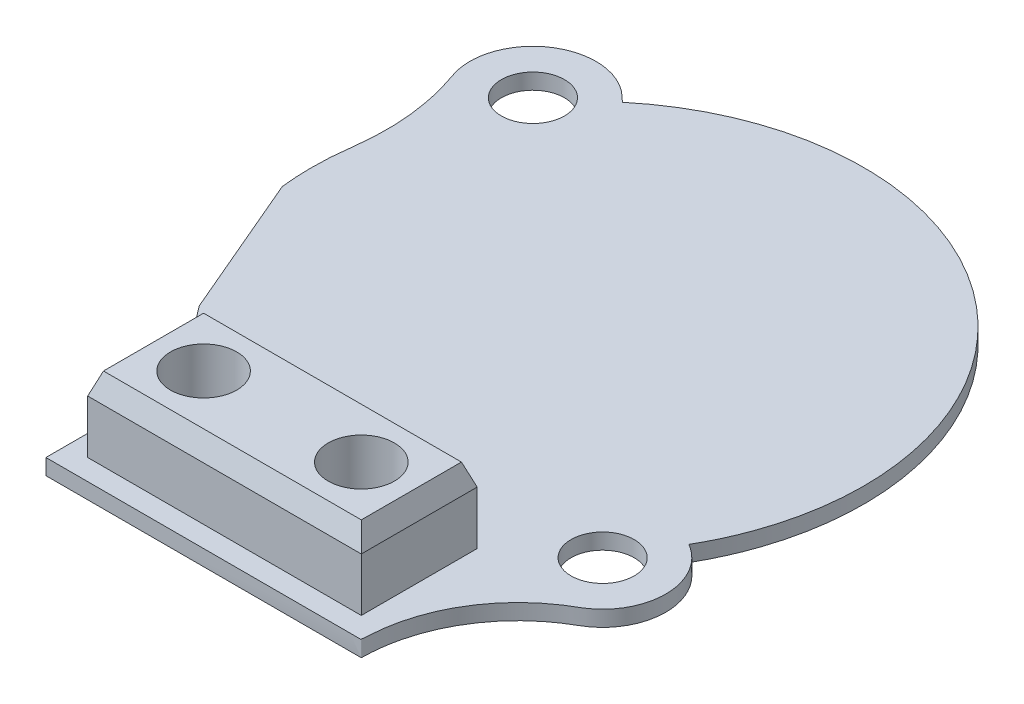
ISO-10303-21;
HEADER;
FILE_DESCRIPTION(('STEP AP214'),'2;1');
FILE_NAME('part.step','',(''),(''),'','','');
FILE_SCHEMA(('AUTOMOTIVE_DESIGN { 1 0 10303 214 1 1 1 1 }'));
ENDSEC;
DATA;
#1=APPLICATION_CONTEXT('core data for automotive mechanical design processes');
#2=APPLICATION_PROTOCOL_DEFINITION('international standard','automotive_design',2000,#1);
#3=PRODUCT_CONTEXT('',#1,'mechanical');
#4=PRODUCT('Part','Part','',(#3));
#5=PRODUCT_RELATED_PRODUCT_CATEGORY('part','',(#4));
#6=PRODUCT_DEFINITION_FORMATION('','',#4);
#7=PRODUCT_DEFINITION_CONTEXT('part definition',#1,'design');
#8=PRODUCT_DEFINITION('design','',#6,#7);
#9=PRODUCT_DEFINITION_SHAPE('','',#8);
#10=(LENGTH_UNIT() NAMED_UNIT(*) SI_UNIT(.MILLI.,.METRE.));
#11=(NAMED_UNIT(*) PLANE_ANGLE_UNIT() SI_UNIT($,.RADIAN.));
#12=(NAMED_UNIT(*) SI_UNIT($,.STERADIAN.) SOLID_ANGLE_UNIT());
#13=UNCERTAINTY_MEASURE_WITH_UNIT(LENGTH_MEASURE(1.E-05),#10,'distance_accuracy_value','');
#14=(GEOMETRIC_REPRESENTATION_CONTEXT(3) GLOBAL_UNCERTAINTY_ASSIGNED_CONTEXT((#13)) GLOBAL_UNIT_ASSIGNED_CONTEXT((#10,
#11,#12)) REPRESENTATION_CONTEXT('',''));
#15=CARTESIAN_POINT('',(0.,0.,0.));
#16=DIRECTION('',(0.,0.,1.));
#17=DIRECTION('',(1.,0.,0.));
#18=AXIS2_PLACEMENT_3D('',#15,#16,#17);
#19=CARTESIAN_POINT('',(0.,23.5,32.3728132326901));
#20=DIRECTION('',(0.,0.342020143325667,-0.939692620785909));
#21=DIRECTION('',(1.,0.,0.));
#22=AXIS2_PLACEMENT_3D('',#19,#20,#21);
#23=PLANE('',#22);
#24=DIRECTION('',(0.323615577118185,-0.889126490715989,-0.323615577118184));
#25=VECTOR('',#24,1.);
#26=CARTESIAN_POINT('',(14.6377128673297,28.2044702326344,34.0851003653604));
#27=LINE('',#26,#25);
#28=CARTESIAN_POINT('',(17.35,20.7525225805454,31.3728132326902));
#29=VERTEX_POINT('',#28);
#30=CARTESIAN_POINT('',(16.35,23.5,32.3728132326901));
#31=VERTEX_POINT('',#30);
#32=EDGE_CURVE('E222',#29,#31,#27,.F.);
#33=ORIENTED_EDGE('',*,*,#32,.F.);
#34=DIRECTION('',(1.,0.,0.));
#35=VECTOR('',#34,1.);
#36=CARTESIAN_POINT('',(17.35,20.7525225805454,31.3728132326902));
#37=LINE('',#36,#35);
#38=CARTESIAN_POINT('',(-17.35,20.7525225805454,31.3728132326902));
#39=VERTEX_POINT('',#38);
#40=EDGE_CURVE('E45',#39,#29,#37,.T.);
#41=ORIENTED_EDGE('',*,*,#40,.F.);
#42=DIRECTION('',(0.323615577118184,0.889126490715989,0.323615577118184));
#43=VECTOR('',#42,1.);
#44=CARTESIAN_POINT('',(-14.6377128673297,28.2044702326344,34.0851003653605));
#45=LINE('',#44,#43);
#46=CARTESIAN_POINT('',(-16.35,23.5,32.3728132326901));
#47=VERTEX_POINT('',#46);
#48=EDGE_CURVE('E226',#47,#39,#45,.F.);
#49=ORIENTED_EDGE('',*,*,#48,.F.);
#50=DIRECTION('',(-1.,0.,0.));
#51=VECTOR('',#50,1.);
#52=CARTESIAN_POINT('',(-17.35,23.5,32.3728132326901));
#53=LINE('',#52,#51);
#54=EDGE_CURVE('E157',#31,#47,#53,.T.);
#55=ORIENTED_EDGE('',*,*,#54,.F.);
#56=EDGE_LOOP('',(#33,#41,#49,#55));
#57=FACE_BOUND('',#56,.T.);
#58=ADVANCED_FACE('F35',(#57),#23,.T.);
#59=CARTESIAN_POINT('',(16.35,23.5,0.));
#60=DIRECTION('',(0.939692620785908,0.342020143325668,0.));
#61=DIRECTION('',(0.,0.,1.));
#62=AXIS2_PLACEMENT_3D('',#59,#60,#61);
#63=PLANE('',#62);
#64=ORIENTED_EDGE('',*,*,#32,.T.);
#65=DIRECTION('',(0.,0.,-1.));
#66=VECTOR('',#65,1.);
#67=CARTESIAN_POINT('',(16.35,23.5,31.3728132326902));
#68=LINE('',#67,#66);
#69=CARTESIAN_POINT('',(16.35,23.5,45.0728132326902));
#70=VERTEX_POINT('',#69);
#71=EDGE_CURVE('E429',#70,#31,#68,.T.);
#72=ORIENTED_EDGE('',*,*,#71,.F.);
#73=DIRECTION('',(0.323615577118185,-0.889126490715989,0.323615577118183));
#74=VECTOR('',#73,1.);
#75=CARTESIAN_POINT('',(11.6296576066308,36.4690341378764,40.3524708393209));
#76=LINE('',#75,#74);
#77=CARTESIAN_POINT('',(17.35,20.7525225805454,46.0728132326902));
#78=VERTEX_POINT('',#77);
#79=EDGE_CURVE('E231',#78,#70,#76,.F.);
#80=ORIENTED_EDGE('',*,*,#79,.F.);
#81=DIRECTION('',(0.,0.,1.));
#82=VECTOR('',#81,1.);
#83=CARTESIAN_POINT('',(17.35,20.7525225805454,46.0728132326902));
#84=LINE('',#83,#82);
#85=EDGE_CURVE('E230',#29,#78,#84,.T.);
#86=ORIENTED_EDGE('',*,*,#85,.F.);
#87=EDGE_LOOP('',(#64,#72,#80,#86));
#88=FACE_BOUND('',#87,.T.);
#89=ADVANCED_FACE('F206',(#88),#63,.T.);
#90=CARTESIAN_POINT('',(0.,23.5,45.0728132326902));
#91=DIRECTION('',(0.,0.342020143325667,0.939692620785909));
#92=DIRECTION('',(-1.,0.,0.));
#93=AXIS2_PLACEMENT_3D('',#90,#91,#92);
#94=PLANE('',#93);
#95=DIRECTION('',(0.323615577118184,0.889126490715989,-0.323615577118184));
#96=VECTOR('',#95,1.);
#97=CARTESIAN_POINT('',(-11.6296576066308,36.4690341378764,40.3524708393209));
#98=LINE('',#97,#96);
#99=CARTESIAN_POINT('',(-16.35,23.5,45.0728132326902));
#100=VERTEX_POINT('',#99);
#101=CARTESIAN_POINT('',(-17.35,20.7525225805454,46.0728132326902));
#102=VERTEX_POINT('',#101);
#103=EDGE_CURVE('E227',#100,#102,#98,.F.);
#104=ORIENTED_EDGE('',*,*,#103,.T.);
#105=DIRECTION('',(-1.,0.,0.));
#106=VECTOR('',#105,1.);
#107=CARTESIAN_POINT('',(-17.35,20.7525225805454,46.0728132326902));
#108=LINE('',#107,#106);
#109=EDGE_CURVE('E234',#78,#102,#108,.T.);
#110=ORIENTED_EDGE('',*,*,#109,.F.);
#111=ORIENTED_EDGE('',*,*,#79,.T.);
#112=DIRECTION('',(1.,0.,0.));
#113=VECTOR('',#112,1.);
#114=CARTESIAN_POINT('',(17.35,23.5,45.0728132326902));
#115=LINE('',#114,#113);
#116=EDGE_CURVE('E238',#100,#70,#115,.T.);
#117=ORIENTED_EDGE('',*,*,#116,.F.);
#118=EDGE_LOOP('',(#104,#110,#111,#117));
#119=FACE_BOUND('',#118,.T.);
#120=ADVANCED_FACE('F202',(#119),#94,.T.);
#121=CARTESIAN_POINT('',(17.35,23.5,46.0728132326902));
#122=DIRECTION('',(0.,0.,-1.));
#123=DIRECTION('',(-1.,0.,0.));
#124=AXIS2_PLACEMENT_3D('',#121,#122,#123);
#125=PLANE('',#124);
#126=DIRECTION('',(0.,-1.,0.));
#127=VECTOR('',#126,1.);
#128=CARTESIAN_POINT('',(17.35,23.5,46.0728132326902));
#129=LINE('',#128,#127);
#130=CARTESIAN_POINT('',(17.35,14.,46.0728132326902));
#131=VERTEX_POINT('',#130);
#132=EDGE_CURVE('E349',#78,#131,#129,.T.);
#133=ORIENTED_EDGE('',*,*,#132,.F.);
#134=ORIENTED_EDGE('',*,*,#109,.T.);
#135=DIRECTION('',(0.,-1.,0.));
#136=VECTOR('',#135,1.);
#137=CARTESIAN_POINT('',(-17.35,23.5,46.0728132326902));
#138=LINE('',#137,#136);
#139=CARTESIAN_POINT('',(-17.35,14.,46.0728132326902));
#140=VERTEX_POINT('',#139);
#141=EDGE_CURVE('E347',#102,#140,#138,.T.);
#142=ORIENTED_EDGE('',*,*,#141,.T.);
#143=DIRECTION('',(1.,0.,0.));
#144=VECTOR('',#143,1.);
#145=CARTESIAN_POINT('',(17.35,14.,46.0728132326902));
#146=LINE('',#145,#144);
#147=EDGE_CURVE('E361',#140,#131,#146,.T.);
#148=ORIENTED_EDGE('',*,*,#147,.T.);
#149=EDGE_LOOP('',(#133,#134,#142,#148));
#150=FACE_BOUND('',#149,.T.);
#151=ADVANCED_FACE('F205',(#150),#125,.F.);
#152=CARTESIAN_POINT('',(17.35,23.5,46.0728132326902));
#153=DIRECTION('',(-1.,0.,0.));
#154=DIRECTION('',(0.,0.,1.));
#155=AXIS2_PLACEMENT_3D('',#152,#153,#154);
#156=PLANE('',#155);
#157=DIRECTION('',(0.,-1.,0.));
#158=VECTOR('',#157,1.);
#159=CARTESIAN_POINT('',(17.35,23.5,31.3728132326902));
#160=LINE('',#159,#158);
#161=CARTESIAN_POINT('',(17.35,14.,31.3728132326902));
#162=VERTEX_POINT('',#161);
#163=EDGE_CURVE('E351',#29,#162,#160,.T.);
#164=ORIENTED_EDGE('',*,*,#163,.F.);
#165=ORIENTED_EDGE('',*,*,#85,.T.);
#166=ORIENTED_EDGE('',*,*,#132,.T.);
#167=DIRECTION('',(0.,0.,-1.));
#168=VECTOR('',#167,1.);
#169=CARTESIAN_POINT('',(17.35,14.,46.0728132326902));
#170=LINE('',#169,#168);
#171=EDGE_CURVE('E358',#131,#162,#170,.T.);
#172=ORIENTED_EDGE('',*,*,#171,.T.);
#173=EDGE_LOOP('',(#164,#165,#166,#172));
#174=FACE_BOUND('',#173,.T.);
#175=ADVANCED_FACE('F403',(#174),#156,.F.);
#176=CARTESIAN_POINT('',(17.35,23.5,31.3728132326902));
#177=DIRECTION('',(0.,0.,1.));
#178=DIRECTION('',(1.,0.,0.));
#179=AXIS2_PLACEMENT_3D('',#176,#177,#178);
#180=PLANE('',#179);
#181=DIRECTION('',(0.,-1.,0.));
#182=VECTOR('',#181,1.);
#183=CARTESIAN_POINT('',(-17.35,23.5,31.3728132326902));
#184=LINE('',#183,#182);
#185=CARTESIAN_POINT('',(-17.35,14.,31.3728132326902));
#186=VERTEX_POINT('',#185);
#187=EDGE_CURVE('E353',#39,#186,#184,.T.);
#188=ORIENTED_EDGE('',*,*,#187,.F.);
#189=ORIENTED_EDGE('',*,*,#40,.T.);
#190=ORIENTED_EDGE('',*,*,#163,.T.);
#191=DIRECTION('',(-1.,0.,0.));
#192=VECTOR('',#191,1.);
#193=CARTESIAN_POINT('',(17.35,14.,31.3728132326902));
#194=LINE('',#193,#192);
#195=EDGE_CURVE('E355',#162,#186,#194,.T.);
#196=ORIENTED_EDGE('',*,*,#195,.T.);
#197=EDGE_LOOP('',(#188,#189,#190,#196));
#198=FACE_BOUND('',#197,.T.);
#199=ADVANCED_FACE('F400',(#198),#180,.F.);
#200=CARTESIAN_POINT('',(-17.35,23.5,46.0728132326902));
#201=DIRECTION('',(1.,0.,0.));
#202=DIRECTION('',(0.,0.,-1.));
#203=AXIS2_PLACEMENT_3D('',#200,#201,#202);
#204=PLANE('',#203);
#205=ORIENTED_EDGE('',*,*,#141,.F.);
#206=DIRECTION('',(0.,0.,-1.));
#207=VECTOR('',#206,1.);
#208=CARTESIAN_POINT('',(-17.35,20.7525225805454,31.3728132326902));
#209=LINE('',#208,#207);
#210=EDGE_CURVE('E53',#102,#39,#209,.T.);
#211=ORIENTED_EDGE('',*,*,#210,.T.);
#212=ORIENTED_EDGE('',*,*,#187,.T.);
#213=DIRECTION('',(0.,0.,1.));
#214=VECTOR('',#213,1.);
#215=CARTESIAN_POINT('',(-17.35,14.,46.0728132326902));
#216=LINE('',#215,#214);
#217=EDGE_CURVE('E364',#186,#140,#216,.T.);
#218=ORIENTED_EDGE('',*,*,#217,.T.);
#219=EDGE_LOOP('',(#205,#211,#212,#218));
#220=FACE_BOUND('',#219,.T.);
#221=ADVANCED_FACE('F191',(#220),#204,.F.);
#222=CARTESIAN_POINT('',(-28.6259218839808,-26.1372871550486,-21.6692546316719));
#223=DIRECTION('',(0.,1.,0.));
#224=DIRECTION('',(0.,0.,1.));
#225=AXIS2_PLACEMENT_3D('',#222,#223,#224);
#226=CYLINDRICAL_SURFACE('',#225,3.99999999999999);
#227=CARTESIAN_POINT('',(-28.6259218839808,12.,-21.6692546316719));
#228=DIRECTION('',(0.,1.,0.));
#229=DIRECTION('',(0.,0.,1.));
#230=AXIS2_PLACEMENT_3D('',#227,#228,#229);
#231=CIRCLE('',#230,3.99999999999999);
#232=CARTESIAN_POINT('',(-28.6259218839808,12.,-17.6692546316719));
#233=VERTEX_POINT('',#232);
#234=EDGE_CURVE('E377',#233,#233,#231,.F.);
#235=ORIENTED_EDGE('',*,*,#234,.T.);
#236=EDGE_LOOP('',(#235));
#237=FACE_BOUND('',#236,.T.);
#238=CARTESIAN_POINT('',(-28.6259218839808,14.,-21.6692546316719));
#239=DIRECTION('',(0.,1.,0.));
#240=DIRECTION('',(0.,0.,1.));
#241=AXIS2_PLACEMENT_3D('',#238,#239,#240);
#242=CIRCLE('',#241,3.99999999999999);
#243=CARTESIAN_POINT('',(-28.6259218839808,14.,-17.6692546316719));
#244=VERTEX_POINT('',#243);
#245=EDGE_CURVE('E332',#244,#244,#242,.T.);
#246=ORIENTED_EDGE('',*,*,#245,.T.);
#247=EDGE_LOOP('',(#246));
#248=FACE_BOUND('',#247,.T.);
#249=ADVANCED_FACE('F187',(#237,#248),#226,.F.);
#250=CARTESIAN_POINT('',(26.3108891324554,-26.1372871550486,24.4282032302754));
#251=DIRECTION('',(0.,1.,0.));
#252=DIRECTION('',(0.,0.,1.));
#253=AXIS2_PLACEMENT_3D('',#250,#251,#252);
#254=CYLINDRICAL_SURFACE('',#253,4.);
#255=CARTESIAN_POINT('',(26.3108891324554,12.,24.4282032302754));
#256=DIRECTION('',(0.,1.,0.));
#257=DIRECTION('',(0.,0.,1.));
#258=AXIS2_PLACEMENT_3D('',#255,#256,#257);
#259=CIRCLE('',#258,4.);
#260=CARTESIAN_POINT('',(26.3108891324554,12.,28.4282032302754));
#261=VERTEX_POINT('',#260);
#262=EDGE_CURVE('E380',#261,#261,#259,.F.);
#263=ORIENTED_EDGE('',*,*,#262,.T.);
#264=EDGE_LOOP('',(#263));
#265=FACE_BOUND('',#264,.T.);
#266=CARTESIAN_POINT('',(26.3108891324554,14.,24.4282032302754));
#267=DIRECTION('',(0.,1.,0.));
#268=DIRECTION('',(0.,0.,1.));
#269=AXIS2_PLACEMENT_3D('',#266,#267,#268);
#270=CIRCLE('',#269,3.99999999999999);
#271=CARTESIAN_POINT('',(26.3108891324554,14.,28.4282032302754));
#272=VERTEX_POINT('',#271);
#273=EDGE_CURVE('E335',#272,#272,#270,.T.);
#274=ORIENTED_EDGE('',*,*,#273,.T.);
#275=EDGE_LOOP('',(#274));
#276=FACE_BOUND('',#275,.T.);
#277=ADVANCED_FACE('F183',(#265,#276),#254,.F.);
#278=CARTESIAN_POINT('',(24.9913632653476,14.,-24.5037091506456));
#279=DIRECTION('',(0.,-1.,0.));
#280=DIRECTION('',(0.,0.,-1.));
#281=AXIS2_PLACEMENT_3D('',#278,#279,#280);
#282=PLANE('',#281);
#283=ORIENTED_EDGE('',*,*,#273,.F.);
#284=EDGE_LOOP('',(#283));
#285=FACE_BOUND('',#284,.T.);
#286=ORIENTED_EDGE('',*,*,#245,.F.);
#287=EDGE_LOOP('',(#286));
#288=FACE_BOUND('',#287,.T.);
#289=CARTESIAN_POINT('',(-20.0539642814219,14.,39.7345241011957));
#290=CARTESIAN_POINT('',(-20.0419776129555,14.,39.9340983018658));
#291=CARTESIAN_POINT('',(-20.0219944397239,14.,40.3334863572757));
#292=CARTESIAN_POINT('',(-20.,14.,40.9333177839603));
#293=CARTESIAN_POINT('',(-20.,14.,41.333185471047));
#294=CARTESIAN_POINT('',(-20.,14.,41.5331193145904));
#295=CARTESIAN_POINT('',(-20.,14.,41.7328330345376));
#296=CARTESIAN_POINT('',(-20.,14.,42.132260474432));
#297=CARTESIAN_POINT('',(-20.,14.,42.7314016342737));
#298=CARTESIAN_POINT('',(-20.,14.,43.1308290741681));
#299=CARTESIAN_POINT('',(-20.,14.,43.3305427941153));
#300=CARTESIAN_POINT('',(-20.,14.,45.1197976527387));
#301=CARTESIAN_POINT('',(-20.,14.,46.9090525113621));
#302=CARTESIAN_POINT('',(-20.,14.,48.6983073699854));
#303=CARTESIAN_POINT('',(-20.,14.,48.7021580948071));
#304=CARTESIAN_POINT('',(-20.,14.,48.7098595444503));
#305=CARTESIAN_POINT('',(-19.9870463117602,14.,48.7228132326902));
#306=CARTESIAN_POINT('',(-19.9793448621169,14.,48.7228132326902));
#307=CARTESIAN_POINT('',(-19.9754941372953,14.,48.7228132326902));
#308=CARTESIAN_POINT('',(-6.65853875298869,14.,48.7228132326902));
#309=CARTESIAN_POINT('',(6.65841663131788,14.,48.7228132326902));
#310=CARTESIAN_POINT('',(19.9753720156244,14.,48.7228132326902));
#311=CARTESIAN_POINT('',(19.9792614200219,14.,48.7228132326902));
#312=CARTESIAN_POINT('',(19.9870402288168,14.,48.7228132326902));
#313=CARTESIAN_POINT('',(20.0000885922753,14.,48.7097824463411));
#314=CARTESIAN_POINT('',(20.0001469571695,14.,48.7020038561761));
#315=CARTESIAN_POINT('',(20.0001772741421,14.,48.6981145699372));
#316=CARTESIAN_POINT('',(20.0553825432791,14.,41.6159729483841));
#317=CARTESIAN_POINT('',(23.5487510677348,14.,35.4551163584433));
#318=CARTESIAN_POINT('',(29.597901634889,14.,31.7717001471833));
#319=CARTESIAN_POINT('',(29.7213656804611,14.,31.6965210849465));
#320=CARTESIAN_POINT('',(29.9699238634443,14.,31.5488400054787));
#321=CARTESIAN_POINT('',(30.3495004712223,14.,31.3385118803131));
#322=CARTESIAN_POINT('',(30.5951469989766,14.,31.1858677525123));
#323=CARTESIAN_POINT('',(30.7158130275729,14.,31.1062752183737));
#324=CARTESIAN_POINT('',(36.2435821574855,14.,27.4601027346926));
#325=CARTESIAN_POINT('',(36.0567065103913,14.,20.8407460569715));
#326=CARTESIAN_POINT('',(30.3320306538226,14.,17.5122491482173));
#327=CARTESIAN_POINT('',(30.3286936933514,14.,17.5103089400918));
#328=CARTESIAN_POINT('',(30.3220169639472,14.,17.5064333541092));
#329=CARTESIAN_POINT('',(30.3174223983614,14.,17.4886804481778));
#330=CARTESIAN_POINT('',(30.3212788098623,14.,17.4819926276814));
#331=CARTESIAN_POINT('',(30.3232064623797,14.,17.4786483985431));
#332=CARTESIAN_POINT('',(55.8458894534531,14.,-26.7999232716034));
#333=CARTESIAN_POINT('',(16.6950526679809,14.,-59.6512738558405));
#334=CARTESIAN_POINT('',(-22.4787601275081,14.,-26.8273245615353));
#335=CARTESIAN_POINT('',(-22.4817187872211,14.,-26.8248454845839));
#336=CARTESIAN_POINT('',(-22.4876352864298,14.,-26.819886351791));
#337=CARTESIAN_POINT('',(-22.5059033329271,14.,-26.8214791641685));
#338=CARTESIAN_POINT('',(-22.510879483787,14.,-26.8273813597896));
#339=CARTESIAN_POINT('',(-22.5133696937618,14.,-26.8303306553174));
#340=CARTESIAN_POINT('',(-28.3276420010242,14.,-33.7164998889151));
#341=CARTESIAN_POINT('',(-36.7671855633217,14.,-30.5543497285288));
#342=CARTESIAN_POINT('',(-36.6249251832458,14.,-21.5429762948614));
#343=CARTESIAN_POINT('',(-36.6158351559796,14.,-20.9671755682382));
#344=CARTESIAN_POINT('',(-36.4733096807584,14.,-19.817537126173));
#345=CARTESIAN_POINT('',(-35.8653337607058,14.,-18.1707400700897));
#346=CARTESIAN_POINT('',(-35.5389504061587,14.,-17.0657106107485));
#347=CARTESIAN_POINT('',(-35.391789637063,14.,-16.5089585892752));
#348=CARTESIAN_POINT('',(-34.6876406414626,14.,-13.8449579923218));
#349=CARTESIAN_POINT('',(-34.354849489947,14.,-11.109638077203));
#350=CARTESIAN_POINT('',(-34.3996836077578,14.,-8.35451287306933));
#351=CARTESIAN_POINT('',(-34.4127219553199,14.,-7.55328644679648));
#352=CARTESIAN_POINT('',(-34.5030035284227,14.,-5.95187839942298));
#353=CARTESIAN_POINT('',(-34.8454802946179,14.,-3.56678199463417));
#354=CARTESIAN_POINT('',(-34.9538792408813,14.,-1.9668400541351));
#355=CARTESIAN_POINT('',(-34.9805739690916,14.,-1.16595231159505));
#356=CARTESIAN_POINT('',(-35.254646004063,14.,7.0566799494637));
#357=CARTESIAN_POINT('',(-32.7275079232087,14.,14.8861352243378));
#358=CARTESIAN_POINT('',(-27.6978968262986,14.,21.3968808801591));
#359=CARTESIAN_POINT('',(-27.5534383521158,14.,21.5838799075412));
#360=CARTESIAN_POINT('',(-27.2607338992553,14.,21.9549520801341));
#361=CARTESIAN_POINT('',(-26.8071985695856,14.,22.499950801493));
#362=CARTESIAN_POINT('',(-26.5117094983527,14.,22.8688206083108));
#363=CARTESIAN_POINT('',(-26.3661643624195,14.,23.0549751151359));
#364=CARTESIAN_POINT('',(-22.5908695106199,14.,27.8836363187578));
#365=CARTESIAN_POINT('',(-20.4214377233599,14.,33.6162086870594));
#366=CARTESIAN_POINT('',(-20.0539642814219,14.,39.7345241011957));
#367=(BOUNDED_CURVE() B_SPLINE_CURVE(3,(#289,#290,#291,#292,#293,#294,#295,#296,#297,#298,#299,
#300,#301,#302,#303,#304,#305,#306,#307,#308,#309,#310,#311,#312,#313,#314,#315,#316,#317,#318,
#319,#320,#321,#322,#323,#324,#325,#326,#327,#328,#329,#330,#331,#332,#333,#334,#335,#336,#337,
#338,#339,#340,#341,#342,#343,#344,#345,#346,#347,#348,#349,#350,#351,#352,#353,#354,#355,#356,
#357,#358,#359,#360,#361,#362,#363,#364,#365,#366),.UNSPECIFIED.,.T.,
.F.) B_SPLINE_CURVE_WITH_KNOTS((4,1,1,3,1,1,3,3,1,1,3,3,1,1,3,3,1,1,3,3,1,1,3,3,1,1,3,3,1,1,3,3,
1,1,3,3,1,1,3,4),(0.,0.00258881210661643,0.00517762421323287,0.0077664363198493,
0.010352398190505,0.0129383600611608,0.0155243219318165,0.0386922086574176,0.0387420691655779,
0.038791929673738,0.0388417901818983,0.211274304413479,0.211324665758078,0.211375027102677,
0.211425388447275,0.295409016589035,0.297280724715327,0.29915243284162,0.301024140967913,
0.359720892045451,0.359770872840928,0.359820853636405,0.359870834431882,0.657371906329194,
0.657421886750765,0.657471867172337,0.657521847593908,0.722563862747865,0.730020457409553,
0.737477052071241,0.744933646732928,0.78038869775361,0.790764626387671,0.801140555021731,
0.811516483655791,0.913847438677078,0.916907110272863,0.919966781868648,0.923026453464433,1.),
.UNSPECIFIED.) CURVE() GEOMETRIC_REPRESENTATION_ITEM() RATIONAL_B_SPLINE_CURVE((1.,1.,1.,1.,1.,
1.,1.,1.,1.,1.,1.,1.,1.,1.,1.,1.,1.,1.,1.,1.,1.,1.,1.,1.,1.,1.,1.,0.91580416757797,
0.91580416757797,1.,1.,1.,1.,1.,1.,0.684559277283954,0.684559277283954,1.,1.,1.,1.,1.,1.,
0.449560136515236,0.449560136515236,1.,1.,1.,1.,1.,1.,0.557358557972477,0.557358557972477,1.,1.,
1.,1.,1.,1.,0.993722363897807,0.993722363897807,1.,1.,1.,1.,1.,1.,0.960596124916538,
0.960596124916538,1.,1.,1.,1.,1.,1.,0.969869947523613,0.969869947523613,1.)) REPRESENTATION_ITEM(''));
#368=CARTESIAN_POINT('',(-26.9247919292513,14.,22.3599691882808));
#369=VERTEX_POINT('',#368);
#370=CARTESIAN_POINT('',(-34.7741817281363,14.,3.96941874064101));
#371=VERTEX_POINT('',#370);
#372=EDGE_CURVE('E164',#369,#371,#367,.T.);
#373=ORIENTED_EDGE('',*,*,#372,.T.);
#374=DIRECTION('',(0.392555240252969,0.,0.919728429129998));
#375=VECTOR('',#374,1.);
#376=CARTESIAN_POINT('',(-26.9230769230769,14.,22.363987323241));
#377=LINE('',#376,#375);
#378=EDGE_CURVE('E141',#371,#369,#377,.T.);
#379=ORIENTED_EDGE('',*,*,#378,.T.);
#380=EDGE_LOOP('',(#373,#379));
#381=FACE_BOUND('',#380,.T.);
#382=ORIENTED_EDGE('',*,*,#217,.F.);
#383=ORIENTED_EDGE('',*,*,#195,.F.);
#384=ORIENTED_EDGE('',*,*,#171,.F.);
#385=ORIENTED_EDGE('',*,*,#147,.F.);
#386=EDGE_LOOP('',(#382,#383,#384,#385));
#387=FACE_BOUND('',#386,.T.);
#388=ADVANCED_FACE('F186',(#285,#288,#381,#387),#282,.F.);
#389=CARTESIAN_POINT('',(-26.9230769230769,14.,22.363987323241));
#390=DIRECTION('',(0.919728429129998,0.,-0.392555240252969));
#391=DIRECTION('',(-0.392555240252969,0.,-0.919728429129998));
#392=AXIS2_PLACEMENT_3D('',#389,#390,#391);
#393=PLANE('',#392);
#394=DIRECTION('',(0.,-1.,0.));
#395=VECTOR('',#394,1.);
#396=CARTESIAN_POINT('',(-34.7741817281363,14.,3.96941874064101));
#397=LINE('',#396,#395);
#398=CARTESIAN_POINT('',(-34.7741817281363,12.,3.96941874064102));
#399=VERTEX_POINT('',#398);
#400=EDGE_CURVE('E138',#371,#399,#397,.T.);
#401=ORIENTED_EDGE('',*,*,#400,.T.);
#402=DIRECTION('',(0.392555240252969,0.,0.919728429129998));
#403=VECTOR('',#402,1.);
#404=CARTESIAN_POINT('',(-26.9230769230769,12.,22.363987323241));
#405=LINE('',#404,#403);
#406=CARTESIAN_POINT('',(-26.9238160683106,12.,22.3618807639031));
#407=VERTEX_POINT('',#406);
#408=EDGE_CURVE('E11',#399,#407,#405,.T.);
#409=ORIENTED_EDGE('',*,*,#408,.T.);
#410=DIRECTION('',(0.,-1.,0.));
#411=VECTOR('',#410,1.);
#412=CARTESIAN_POINT('',(-26.9247919292513,14.,22.3599691882808));
#413=LINE('',#412,#411);
#414=EDGE_CURVE('E145',#369,#407,#413,.T.);
#415=ORIENTED_EDGE('',*,*,#414,.F.);
#416=ORIENTED_EDGE('',*,*,#378,.F.);
#417=EDGE_LOOP('',(#401,#409,#415,#416));
#418=FACE_BOUND('',#417,.T.);
#419=ADVANCED_FACE('F139',(#418),#393,.F.);
#420=DIRECTION('',(0.,-1.,0.));
#421=VECTOR('',#420,1.);
#422=SURFACE_OF_LINEAR_EXTRUSION('',#367,#421);
#423=CARTESIAN_POINT('',(-34.674304903846,12.,-4.76346350560542));
#424=CARTESIAN_POINT('',(-34.7234870151677,12.,-4.36392144844072));
#425=CARTESIAN_POINT('',(-34.8724873008072,12.,-3.16816518719367));
#426=CARTESIAN_POINT('',(-34.9538792408813,12.,-1.9668400541351));
#427=CARTESIAN_POINT('',(-34.9805739690916,12.,-1.16595231159505));
#428=CARTESIAN_POINT('',(-35.0375551791723,12.,0.543581958594167));
#429=CARTESIAN_POINT('',(-34.9694791650009,12.,2.25851117348606));
#430=CARTESIAN_POINT('',(-34.7741817281363,12.,3.96941874064084));
#431=(BOUNDED_CURVE() B_SPLINE_CURVE(3,(#423,#424,#425,#426,#427,#428,#429,#430),.UNSPECIFIED.,
.F.,.F.) B_SPLINE_CURVE_WITH_KNOTS((4,1,3,4),(0.795934838433052,0.801140555021731,
0.811516483655791,0.833477125509054),
.UNSPECIFIED.) CURVE() GEOMETRIC_REPRESENTATION_ITEM() RATIONAL_B_SPLINE_CURVE((1.,1.,1.,1.,1.,
0.991543767101962,0.984902276400584,0.980075527895865)) REPRESENTATION_ITEM(''));
#432=CARTESIAN_POINT('',(-34.6743579605585,12.,-4.76346984523655));
#433=VERTEX_POINT('',#432);
#434=EDGE_CURVE('E129',#399,#433,#431,.F.);
#435=ORIENTED_EDGE('',*,*,#434,.F.);
#436=ORIENTED_EDGE('',*,*,#400,.F.);
#437=ORIENTED_EDGE('',*,*,#372,.F.);
#438=ORIENTED_EDGE('',*,*,#414,.T.);
#439=CARTESIAN_POINT('',(-26.9221295875927,12.,22.3632079686049));
#440=CARTESIAN_POINT('',(-26.786112893301,12.,22.5281243556773));
#441=CARTESIAN_POINT('',(-26.6515293503411,12.,22.6942285055461));
#442=CARTESIAN_POINT('',(-26.3855621133402,12.,23.0291244336328));
#443=CARTESIAN_POINT('',(-26.2541801969292,12.,23.1979176225795));
#444=CARTESIAN_POINT('',(-25.8644527643775,12.,23.7099802921607));
#445=CARTESIAN_POINT('',(-25.6116932234009,12.,24.0575295980044));
#446=CARTESIAN_POINT('',(-25.1199821661697,12.,24.7649916076701));
#447=CARTESIAN_POINT('',(-24.8811114304649,12.,25.1249603365665));
#448=CARTESIAN_POINT('',(-24.4181301711811,12.,25.8564983468692));
#449=CARTESIAN_POINT('',(-24.1940893044888,12.,26.2281117454157));
#450=CARTESIAN_POINT('',(-23.761582481546,12.,26.9820068670359));
#451=CARTESIAN_POINT('',(-23.5531732454765,12.,27.3643211240514));
#452=CARTESIAN_POINT('',(-23.152686306911,12.,28.1386340420615));
#453=CARTESIAN_POINT('',(-22.9606511402857,12.,28.5306547053058));
#454=CARTESIAN_POINT('',(-22.593578504961,12.,29.3233231975944));
#455=CARTESIAN_POINT('',(-22.4185682237135,12.,29.7239836166441));
#456=CARTESIAN_POINT('',(-22.0861202108983,12.,30.5328184930888));
#457=CARTESIAN_POINT('',(-21.928693375608,12.,30.9409974291422));
#458=CARTESIAN_POINT('',(-21.6318879321883,12.,31.7637084063569));
#459=CARTESIAN_POINT('',(-21.4925032086445,12.,32.1782382413061));
#460=CARTESIAN_POINT('',(-21.2321544403969,12.,33.0124539932991));
#461=CARTESIAN_POINT('',(-21.1111667910119,12.,33.4321325436779));
#462=CARTESIAN_POINT('',(-20.8878774295048,12.,34.2754235378856));
#463=CARTESIAN_POINT('',(-20.7855344000796,12.,34.6990250422589));
#464=CARTESIAN_POINT('',(-20.5996930708523,12.,35.5489280761509));
#465=CARTESIAN_POINT('',(-20.5161357685896,12.,35.9752167029897));
#466=CARTESIAN_POINT('',(-20.3679093236947,12.,36.8292541510859));
#467=CARTESIAN_POINT('',(-20.3031638056862,12.,37.256989727317));
#468=CARTESIAN_POINT('',(-20.1925229839304,12.,38.1127096070622));
#469=CARTESIAN_POINT('',(-20.1465343434349,12.,38.5406817977593));
#470=CARTESIAN_POINT('',(-20.0878790130395,12.,39.22421170157));
#471=CARTESIAN_POINT('',(-20.0692631302577,12.,39.479270935793));
#472=CARTESIAN_POINT('',(-20.0449923248057,12.,39.8842164310388));
#473=CARTESIAN_POINT('',(-20.0371611609037,12.,40.0339754575995));
#474=CARTESIAN_POINT('',(-20.022997400613,12.,40.3336135001885));
#475=CARTESIAN_POINT('',(-20.0166652868702,12.,40.4834925393146));
#476=CARTESIAN_POINT('',(-20.0090999262128,12.,40.7083784685587));
#477=CARTESIAN_POINT('',(-20.0069002813155,12.,40.7833512479184));
#478=CARTESIAN_POINT('',(-20.0035154193339,12.,40.9333035989528));
#479=CARTESIAN_POINT('',(-20.0023299767541,12.,41.0082831654089));
#480=CARTESIAN_POINT('',(-20.0007630909884,12.,41.1582394262468));
#481=CARTESIAN_POINT('',(-20.000381545557,12.,41.2332161197808));
#482=CARTESIAN_POINT('',(-20.0000050801099,12.,41.3831689812992));
#483=CARTESIAN_POINT('',(-20.0000101505311,12.,41.4581451492507));
#484=CARTESIAN_POINT('',(-20.,12.,41.5331193145904));
#485=B_SPLINE_CURVE_WITH_KNOTS('',3,(#439,#440,#441,#442,#443,#444,#445,#446,#447,#448,#449,
#450,#451,#452,#453,#454,#455,#456,#457,#458,#459,#460,#461,#462,#463,#464,#465,#466,#467,#468,
#469,#470,#471,#472,#473,#474,#475,#476,#477,#478,#479,#480,#481,#482,#483,#484),.UNSPECIFIED.,
.F.,.F.,(4,2,2,2,2,2,2,2,2,2,2,2,2,2,2,2,2,2,2,2,2,2,4),(0.,0.641308284175929,1.28296488120481,
2.57175011858924,3.86740482788718,5.16876713423358,6.47464346510088,7.78381488076584,
9.09504375727967,10.4070807324819,11.71867181874,13.0285655816977,14.3355202825651,
15.6383108824492,16.9357358108739,18.2266234068094,18.9937534331964,19.4436341653756,
19.8936595482857,20.1186696869747,20.3436297844008,20.568561268035,20.7934871878491),.UNSPECIFIED.);
#486=CARTESIAN_POINT('',(-20.,12.,41.5331193145904));
#487=VERTEX_POINT('',#486);
#488=EDGE_CURVE('E133',#487,#407,#485,.F.);
#489=ORIENTED_EDGE('',*,*,#488,.F.);
#490=CARTESIAN_POINT('',(-20.,12.,41.5331193145904));
#491=CARTESIAN_POINT('',(-20.,12.,41.7328330345376));
#492=CARTESIAN_POINT('',(-20.,12.,42.132260474432));
#493=CARTESIAN_POINT('',(-20.,12.,42.7314016342737));
#494=CARTESIAN_POINT('',(-20.,12.,43.1308290741681));
#495=CARTESIAN_POINT('',(-20.,12.,43.3305427941153));
#496=CARTESIAN_POINT('',(-20.,12.,45.1197976527387));
#497=CARTESIAN_POINT('',(-20.,12.,46.9090525113621));
#498=CARTESIAN_POINT('',(-20.,12.,48.6983073699854));
#499=CARTESIAN_POINT('',(-20.,12.,48.7021580948071));
#500=CARTESIAN_POINT('',(-20.,12.,48.7077539439591));
#501=CARTESIAN_POINT('',(-19.9954407939672,12.,48.7138430727037));
#502=CARTESIAN_POINT('',(-19.9937982377222,12.,48.715567311716));
#503=(BOUNDED_CURVE() B_SPLINE_CURVE(3,(#490,#491,#492,#493,#494,#495,#496,#497,#498,#499,#500,
#501,#502),.UNSPECIFIED.,.F.,.F.) B_SPLINE_CURVE_WITH_KNOTS((4,1,1,3,3,1,4),(0.0077664363198493,
0.010352398190505,0.0129383600611608,0.0155243219318165,0.0386922086574176,0.0387420691655779,
0.0387646656350599),
.UNSPECIFIED.) CURVE() GEOMETRIC_REPRESENTATION_ITEM() RATIONAL_B_SPLINE_CURVE((1.,1.,1.,1.,1.,
1.,1.,1.,1.,1.,1.,1.,1.)) REPRESENTATION_ITEM(''));
#504=CARTESIAN_POINT('',(-19.9918148031231,12.,48.7164910113612));
#505=VERTEX_POINT('',#504);
#506=EDGE_CURVE('E327',#487,#505,#503,.T.);
#507=ORIENTED_EDGE('',*,*,#506,.T.);
#508=CARTESIAN_POINT('',(-19.9937982377222,12.,48.715567311716));
#509=CARTESIAN_POINT('',(-19.9918163919728,12.,48.7176477127786));
#510=CARTESIAN_POINT('',(-19.9853011874298,12.,48.7228132326902));
#511=CARTESIAN_POINT('',(-19.9793448621169,12.,48.7228132326902));
#512=CARTESIAN_POINT('',(-19.9754941372953,12.,48.7228132326902));
#513=CARTESIAN_POINT('',(-6.65853875298869,12.,48.7228132326902));
#514=CARTESIAN_POINT('',(6.65841663131788,12.,48.7228132326902));
#515=CARTESIAN_POINT('',(19.9753720156244,12.,48.7228132326902));
#516=CARTESIAN_POINT('',(19.9785312279083,12.,48.7228132326902));
#517=CARTESIAN_POINT('',(19.9816904401921,12.,48.7228132326902));
#518=CARTESIAN_POINT('',(19.9849729238533,12.,48.7216493572623));
#519=(BOUNDED_CURVE() B_SPLINE_CURVE(3,(#508,#509,#510,#511,#512,#513,#514,#515,#516,#517,#518),
.UNSPECIFIED.,.F.,.F.) B_SPLINE_CURVE_WITH_KNOTS((4,1,3,3,4),(0.0387646656350599,
0.038791929673738,0.0388417901818983,0.211274304413479,0.211315210979685),
.UNSPECIFIED.) CURVE() GEOMETRIC_REPRESENTATION_ITEM() RATIONAL_B_SPLINE_CURVE((1.,1.,1.,1.,1.,
1.,1.,1.,1.,1.,1.)) REPRESENTATION_ITEM(''));
#520=CARTESIAN_POINT('',(19.9870207327391,12.,48.7218190992045));
#521=VERTEX_POINT('',#520);
#522=EDGE_CURVE('E318',#505,#521,#519,.T.);
#523=ORIENTED_EDGE('',*,*,#522,.T.);
#524=CARTESIAN_POINT('',(19.9849729238533,12.,48.7216493572623));
#525=CARTESIAN_POINT('',(19.9857316078122,12.,48.72138034949));
#526=CARTESIAN_POINT('',(19.9905731219378,12.,48.7192850986371));
#527=CARTESIAN_POINT('',(20.0000885922753,12.,48.7097824463411));
#528=CARTESIAN_POINT('',(20.0001469571695,12.,48.7020038561761));
#529=CARTESIAN_POINT('',(20.0001772741421,12.,48.6981145699372));
#530=CARTESIAN_POINT('',(20.0553825432791,12.,41.6159729483841));
#531=CARTESIAN_POINT('',(23.5487510677348,12.,35.4551163584433));
#532=CARTESIAN_POINT('',(29.597901634889,12.,31.7717001471833));
#533=CARTESIAN_POINT('',(29.7213656804611,12.,31.6965210849465));
#534=CARTESIAN_POINT('',(29.9284750114017,12.,31.5734668801158));
#535=CARTESIAN_POINT('',(30.1387037266061,12.,31.4555937232584));
#536=CARTESIAN_POINT('',(30.2223998815375,12.,31.4078088732231));
#537=(BOUNDED_CURVE() B_SPLINE_CURVE(3,(#524,#525,#526,#527,#528,#529,#530,#531,#532,#533,#534,
#535,#536),.UNSPECIFIED.,.F.,.F.) B_SPLINE_CURVE_WITH_KNOTS((4,1,1,3,3,1,4),(0.211315210979685,
0.211324665758078,0.211375027102677,0.211425388447275,0.295409016589035,0.297280724715327,
0.29852819144862),
.UNSPECIFIED.) CURVE() GEOMETRIC_REPRESENTATION_ITEM() RATIONAL_B_SPLINE_CURVE((1.,1.,1.,1.,1.,
1.,0.91580416757797,0.91580416757797,1.,1.,1.,1.,1.)) REPRESENTATION_ITEM(''));
#538=CARTESIAN_POINT('',(30.2223015909379,12.,31.4076366845718));
#539=VERTEX_POINT('',#538);
#540=EDGE_CURVE('E307',#539,#521,#537,.F.);
#541=ORIENTED_EDGE('',*,*,#540,.F.);
#542=CARTESIAN_POINT('',(30.2223998815375,12.,31.4078088732231));
#543=CARTESIAN_POINT('',(30.2642820439623,12.,31.3838969879965));
#544=CARTESIAN_POINT('',(30.4313604223593,12.,31.287644314802));
#545=CARTESIAN_POINT('',(30.5951469989766,12.,31.1858677525123));
#546=CARTESIAN_POINT('',(30.7158130275729,12.,31.1062752183737));
#547=CARTESIAN_POINT('',(36.2435821574855,12.,27.4601027346926));
#548=CARTESIAN_POINT('',(36.0567065103913,12.,20.8407460569715));
#549=CARTESIAN_POINT('',(30.3320306538226,12.,17.5122491482173));
#550=CARTESIAN_POINT('',(30.3286936933514,12.,17.5103089400918));
#551=CARTESIAN_POINT('',(30.3234955166155,12.,17.5072915973671));
#552=CARTESIAN_POINT('',(30.3204877473222,12.,17.4994495537649));
#553=CARTESIAN_POINT('',(30.3198349072112,12.,17.4965927860537));
#554=(BOUNDED_CURVE() B_SPLINE_CURVE(3,(#542,#543,#544,#545,#546,#547,#548,#549,#550,#551,#552,
#553),.UNSPECIFIED.,.F.,.F.) B_SPLINE_CURVE_WITH_KNOTS((4,1,3,3,1,4),(0.29852819144862,
0.29915243284162,0.301024140967913,0.359720892045451,0.359770872840928,0.359798717277705),
.UNSPECIFIED.) CURVE() GEOMETRIC_REPRESENTATION_ITEM() RATIONAL_B_SPLINE_CURVE((1.,1.,1.,1.,1.,
0.684559277283954,0.684559277283954,1.,1.,1.,1.,1.)) REPRESENTATION_ITEM(''));
#555=CARTESIAN_POINT('',(30.3183778679399,12.,17.4973164033699));
#556=VERTEX_POINT('',#555);
#557=EDGE_CURVE('E296',#539,#556,#554,.T.);
#558=ORIENTED_EDGE('',*,*,#557,.T.);
#559=CARTESIAN_POINT('',(30.3198349072112,12.,17.4965927860537));
#560=CARTESIAN_POINT('',(30.3193158985854,12.,17.4943216524955));
#561=CARTESIAN_POINT('',(30.3184966070169,12.,17.4868175467052));
#562=CARTESIAN_POINT('',(30.3212788098623,12.,17.4819926276814));
#563=CARTESIAN_POINT('',(30.3232064623797,12.,17.4786483985431));
#564=CARTESIAN_POINT('',(55.8458894534531,12.,-26.7999232716034));
#565=CARTESIAN_POINT('',(16.6950526679809,12.,-59.6512738558405));
#566=CARTESIAN_POINT('',(-22.4787601275081,12.,-26.8273245615353));
#567=CARTESIAN_POINT('',(-22.4817187872211,12.,-26.8248454845839));
#568=CARTESIAN_POINT('',(-22.4863118561457,12.,-26.8209956338664));
#569=CARTESIAN_POINT('',(-22.4946789357986,12.,-26.8207744365455));
#570=CARTESIAN_POINT('',(-22.4975670415666,12.,-26.8211055929962));
#571=(BOUNDED_CURVE() B_SPLINE_CURVE(3,(#559,#560,#561,#562,#563,#564,#565,#566,#567,#568,#569,
#570),.UNSPECIFIED.,.F.,.F.) B_SPLINE_CURVE_WITH_KNOTS((4,1,3,3,1,4),(0.359798717277705,
0.359820853636405,0.359870834431882,0.657371906329194,0.657421886750765,0.657449507462248),
.UNSPECIFIED.) CURVE() GEOMETRIC_REPRESENTATION_ITEM() RATIONAL_B_SPLINE_CURVE((1.,1.,1.,1.,1.,
0.449560136515236,0.449560136515236,1.,1.,1.,1.,1.)) REPRESENTATION_ITEM(''));
#572=CARTESIAN_POINT('',(-22.4973903552453,12.,-26.8190910854068));
#573=VERTEX_POINT('',#572);
#574=EDGE_CURVE('E152',#573,#556,#571,.F.);
#575=ORIENTED_EDGE('',*,*,#574,.F.);
#576=CARTESIAN_POINT('',(-22.4975670415666,12.,-26.8211055929962));
#577=CARTESIAN_POINT('',(-22.4999050409956,12.,-26.8213736730648));
#578=CARTESIAN_POINT('',(-22.5072783196006,12.,-26.8231100311884));
#579=CARTESIAN_POINT('',(-22.510879483787,12.,-26.8273813597896));
#580=CARTESIAN_POINT('',(-22.5133696937618,12.,-26.8303306553174));
#581=CARTESIAN_POINT('',(-28.3276420010242,12.,-33.7164998889151));
#582=CARTESIAN_POINT('',(-36.7671855633217,12.,-30.5543497285288));
#583=CARTESIAN_POINT('',(-36.6249251832458,12.,-21.5429762948614));
#584=CARTESIAN_POINT('',(-36.6158351559796,12.,-20.9671755682382));
#585=CARTESIAN_POINT('',(-36.5078167133057,12.,-20.0958776198739));
#586=CARTESIAN_POINT('',(-36.2488519103674,12.,-19.2543182598776));
#587=CARTESIAN_POINT('',(-36.1549780041685,12.,-18.9693803073851));
#588=(BOUNDED_CURVE() B_SPLINE_CURVE(3,(#576,#577,#578,#579,#580,#581,#582,#583,#584,#585,#586,
#587),.UNSPECIFIED.,.F.,.F.) B_SPLINE_CURVE_WITH_KNOTS((4,1,3,3,1,4),(0.657449507462248,
0.657471867172337,0.657521847593908,0.722563862747865,0.730020457409553,0.733866399950504),
.UNSPECIFIED.) CURVE() GEOMETRIC_REPRESENTATION_ITEM() RATIONAL_B_SPLINE_CURVE((1.,1.,1.,1.,1.,
0.557358557972477,0.557358557972477,1.,1.,1.,1.,1.)) REPRESENTATION_ITEM(''));
#589=CARTESIAN_POINT('',(-36.1553335880047,12.,-18.9692609912992));
#590=VERTEX_POINT('',#589);
#591=EDGE_CURVE('E153',#573,#590,#588,.T.);
#592=ORIENTED_EDGE('',*,*,#591,.T.);
#593=CARTESIAN_POINT('',(-36.1549780041685,12.,-18.9693803073851));
#594=CARTESIAN_POINT('',(-36.0668471975092,12.,-18.7018745369553));
#595=CARTESIAN_POINT('',(-35.7811631919098,12.,-17.8857654939256));
#596=CARTESIAN_POINT('',(-35.5389504061587,12.,-17.0657106107485));
#597=CARTESIAN_POINT('',(-35.391789637063,12.,-16.5089585892752));
#598=CARTESIAN_POINT('',(-34.6876406414626,12.,-13.8449579923218));
#599=CARTESIAN_POINT('',(-34.354849489947,12.,-11.109638077203));
#600=CARTESIAN_POINT('',(-34.3996836077578,12.,-8.35451287306933));
#601=CARTESIAN_POINT('',(-34.4127219553199,12.,-7.55328644679648));
#602=CARTESIAN_POINT('',(-34.4803559033605,12.,-6.35360034313848));
#603=CARTESIAN_POINT('',(-34.6254582292258,12.,-5.16028056650379));
#604=CARTESIAN_POINT('',(-34.674304903846,12.,-4.76346350560542));
#605=(BOUNDED_CURVE() B_SPLINE_CURVE(3,(#593,#594,#595,#596,#597,#598,#599,#600,#601,#602,#603,
#604),.UNSPECIFIED.,.F.,.F.) B_SPLINE_CURVE_WITH_KNOTS((4,1,3,3,1,4),(0.733866399950504,
0.737477052071241,0.744933646732928,0.78038869775361,0.790764626387671,0.795934838433052),
.UNSPECIFIED.) CURVE() GEOMETRIC_REPRESENTATION_ITEM() RATIONAL_B_SPLINE_CURVE((1.,1.,1.,1.,1.,
0.993722363897807,0.993722363897807,1.,1.,1.,1.,1.)) REPRESENTATION_ITEM(''));
#606=EDGE_CURVE('E150',#433,#590,#605,.F.);
#607=ORIENTED_EDGE('',*,*,#606,.F.);
#608=EDGE_LOOP('',(#435,#436,#437,#438,#489,#507,#523,#541,#558,#575,#592,#607));
#609=FACE_BOUND('',#608,.T.);
#610=ADVANCED_FACE('F148',(#609),#422,.F.);
#611=CARTESIAN_POINT('',(-16.35,23.5,0.));
#612=DIRECTION('',(-0.939692620785909,0.342020143325668,0.));
#613=DIRECTION('',(0.,0.,-1.));
#614=AXIS2_PLACEMENT_3D('',#611,#612,#613);
#615=PLANE('',#614);
#616=ORIENTED_EDGE('',*,*,#48,.T.);
#617=ORIENTED_EDGE('',*,*,#210,.F.);
#618=ORIENTED_EDGE('',*,*,#103,.F.);
#619=DIRECTION('',(0.,0.,1.));
#620=VECTOR('',#619,1.);
#621=CARTESIAN_POINT('',(-16.35,23.5,46.0728132326902));
#622=LINE('',#621,#620);
#623=EDGE_CURVE('E428',#47,#100,#622,.T.);
#624=ORIENTED_EDGE('',*,*,#623,.F.);
#625=EDGE_LOOP('',(#616,#617,#618,#624));
#626=FACE_BOUND('',#625,.T.);
#627=ADVANCED_FACE('F180',(#626),#615,.T.);
#628=CARTESIAN_POINT('',(-10.,0.,38.7228132326902));
#629=DIRECTION('',(0.,1.,0.));
#630=DIRECTION('',(0.,0.,1.));
#631=AXIS2_PLACEMENT_3D('',#628,#629,#630);
#632=CYLINDRICAL_SURFACE('',#631,4.2);
#633=CARTESIAN_POINT('',(-10.,12.,38.7228132326902));
#634=DIRECTION('',(0.,1.,0.));
#635=DIRECTION('',(0.,0.,1.));
#636=AXIS2_PLACEMENT_3D('',#633,#634,#635);
#637=CIRCLE('',#636,4.2);
#638=CARTESIAN_POINT('',(-10.,12.,42.9228132326902));
#639=VERTEX_POINT('',#638);
#640=EDGE_CURVE('E244',#639,#639,#637,.F.);
#641=ORIENTED_EDGE('',*,*,#640,.T.);
#642=EDGE_LOOP('',(#641));
#643=FACE_BOUND('',#642,.T.);
#644=CARTESIAN_POINT('',(-10.,23.5,38.7228132326902));
#645=DIRECTION('',(0.,1.,0.));
#646=DIRECTION('',(0.,0.,1.));
#647=AXIS2_PLACEMENT_3D('',#644,#645,#646);
#648=CIRCLE('',#647,4.2);
#649=CARTESIAN_POINT('',(-10.,23.5,42.9228132326902));
#650=VERTEX_POINT('',#649);
#651=EDGE_CURVE('E367',#650,#650,#648,.T.);
#652=ORIENTED_EDGE('',*,*,#651,.T.);
#653=EDGE_LOOP('',(#652));
#654=FACE_BOUND('',#653,.T.);
#655=ADVANCED_FACE('F198',(#643,#654),#632,.F.);
#656=CARTESIAN_POINT('',(0.,23.5,0.));
#657=DIRECTION('',(0.,1.,0.));
#658=DIRECTION('',(0.,0.,1.));
#659=AXIS2_PLACEMENT_3D('',#656,#657,#658);
#660=PLANE('',#659);
#661=ORIENTED_EDGE('',*,*,#623,.T.);
#662=ORIENTED_EDGE('',*,*,#116,.T.);
#663=ORIENTED_EDGE('',*,*,#71,.T.);
#664=ORIENTED_EDGE('',*,*,#54,.T.);
#665=EDGE_LOOP('',(#661,#662,#663,#664));
#666=FACE_BOUND('',#665,.T.);
#667=ORIENTED_EDGE('',*,*,#651,.F.);
#668=EDGE_LOOP('',(#667));
#669=FACE_BOUND('',#668,.T.);
#670=CARTESIAN_POINT('',(9.99999999999999,23.5,38.7228132326902));
#671=DIRECTION('',(0.,1.,0.));
#672=DIRECTION('',(0.,0.,1.));
#673=AXIS2_PLACEMENT_3D('',#670,#671,#672);
#674=CIRCLE('',#673,4.2);
#675=CARTESIAN_POINT('',(9.99999999999999,23.5,42.9228132326902));
#676=VERTEX_POINT('',#675);
#677=EDGE_CURVE('E246',#676,#676,#674,.T.);
#678=ORIENTED_EDGE('',*,*,#677,.F.);
#679=EDGE_LOOP('',(#678));
#680=FACE_BOUND('',#679,.T.);
#681=ADVANCED_FACE('F196',(#666,#669,#680),#660,.T.);
#682=CARTESIAN_POINT('',(9.99999999999999,0.,38.7228132326902));
#683=DIRECTION('',(0.,1.,0.));
#684=DIRECTION('',(0.,0.,1.));
#685=AXIS2_PLACEMENT_3D('',#682,#683,#684);
#686=CYLINDRICAL_SURFACE('',#685,4.2);
#687=CARTESIAN_POINT('',(9.99999999999999,12.,38.7228132326902));
#688=DIRECTION('',(0.,1.,0.));
#689=DIRECTION('',(0.,0.,1.));
#690=AXIS2_PLACEMENT_3D('',#687,#688,#689);
#691=CIRCLE('',#690,4.2);
#692=CARTESIAN_POINT('',(9.99999999999999,12.,42.9228132326902));
#693=VERTEX_POINT('',#692);
#694=EDGE_CURVE('E374',#693,#693,#691,.F.);
#695=ORIENTED_EDGE('',*,*,#694,.T.);
#696=EDGE_LOOP('',(#695));
#697=FACE_BOUND('',#696,.T.);
#698=ORIENTED_EDGE('',*,*,#677,.T.);
#699=EDGE_LOOP('',(#698));
#700=FACE_BOUND('',#699,.T.);
#701=ADVANCED_FACE('F193',(#697,#700),#686,.F.);
#702=CARTESIAN_POINT('',(24.9913632653476,12.,-24.5037091506456));
#703=DIRECTION('',(0.,-1.,0.));
#704=DIRECTION('',(0.,0.,-1.));
#705=AXIS2_PLACEMENT_3D('',#702,#703,#704);
#706=PLANE('',#705);
#707=ORIENTED_EDGE('',*,*,#694,.F.);
#708=EDGE_LOOP('',(#707));
#709=FACE_BOUND('',#708,.T.);
#710=ORIENTED_EDGE('',*,*,#262,.F.);
#711=EDGE_LOOP('',(#710));
#712=FACE_BOUND('',#711,.T.);
#713=ORIENTED_EDGE('',*,*,#488,.T.);
#714=ORIENTED_EDGE('',*,*,#408,.F.);
#715=ORIENTED_EDGE('',*,*,#434,.T.);
#716=ORIENTED_EDGE('',*,*,#606,.T.);
#717=ORIENTED_EDGE('',*,*,#591,.F.);
#718=ORIENTED_EDGE('',*,*,#574,.T.);
#719=ORIENTED_EDGE('',*,*,#557,.F.);
#720=ORIENTED_EDGE('',*,*,#540,.T.);
#721=ORIENTED_EDGE('',*,*,#522,.F.);
#722=ORIENTED_EDGE('',*,*,#506,.F.);
#723=EDGE_LOOP('',(#713,#714,#715,#716,#717,#718,#719,#720,#721,#722));
#724=FACE_BOUND('',#723,.T.);
#725=ORIENTED_EDGE('',*,*,#234,.F.);
#726=EDGE_LOOP('',(#725));
#727=FACE_BOUND('',#726,.T.);
#728=ORIENTED_EDGE('',*,*,#640,.F.);
#729=EDGE_LOOP('',(#728));
#730=FACE_BOUND('',#729,.T.);
#731=ADVANCED_FACE('F126',(#709,#712,#724,#727,#730),#706,.T.);
#732=CLOSED_SHELL('',(#58,#89,#120,#151,#175,#199,#221,#249,#277,#388,#419,#610,#627,#655,#681,
#701,#731));
#733=MANIFOLD_SOLID_BREP('B2',#732);
#734=ADVANCED_BREP_SHAPE_REPRESENTATION('',(#18,#733),#14);
#735=SHAPE_DEFINITION_REPRESENTATION(#9,#734);
ENDSEC;
END-ISO-10303-21;
